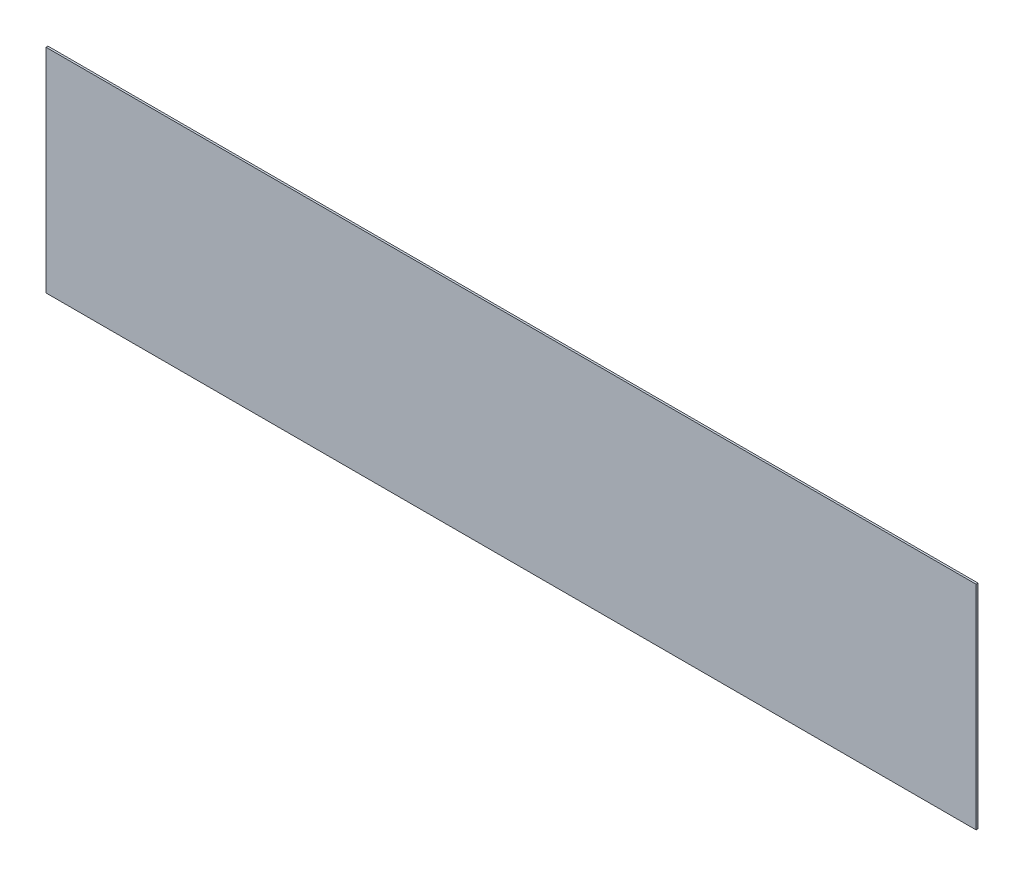
ISO-10303-21;
HEADER;
FILE_DESCRIPTION(('STEP AP214'),'2;1');
FILE_NAME('part.step','',(''),(''),'','','');
FILE_SCHEMA(('AUTOMOTIVE_DESIGN { 1 0 10303 214 1 1 1 1 }'));
ENDSEC;
DATA;
#1=APPLICATION_CONTEXT('core data for automotive mechanical design processes');
#2=APPLICATION_PROTOCOL_DEFINITION('international standard','automotive_design',2000,#1);
#3=PRODUCT_CONTEXT('',#1,'mechanical');
#4=PRODUCT('Part','Part','',(#3));
#5=PRODUCT_RELATED_PRODUCT_CATEGORY('part','',(#4));
#6=PRODUCT_DEFINITION_FORMATION('','',#4);
#7=PRODUCT_DEFINITION_CONTEXT('part definition',#1,'design');
#8=PRODUCT_DEFINITION('design','',#6,#7);
#9=PRODUCT_DEFINITION_SHAPE('','',#8);
#10=(LENGTH_UNIT() NAMED_UNIT(*) SI_UNIT(.MILLI.,.METRE.));
#11=(NAMED_UNIT(*) PLANE_ANGLE_UNIT() SI_UNIT($,.RADIAN.));
#12=(NAMED_UNIT(*) SI_UNIT($,.STERADIAN.) SOLID_ANGLE_UNIT());
#13=UNCERTAINTY_MEASURE_WITH_UNIT(LENGTH_MEASURE(1.E-05),#10,'distance_accuracy_value','');
#14=(GEOMETRIC_REPRESENTATION_CONTEXT(3) GLOBAL_UNCERTAINTY_ASSIGNED_CONTEXT((#13)) GLOBAL_UNIT_ASSIGNED_CONTEXT((#10,
#11,#12)) REPRESENTATION_CONTEXT('',''));
#15=CARTESIAN_POINT('',(0.,0.,0.));
#16=DIRECTION('',(0.,0.,1.));
#17=DIRECTION('',(1.,0.,0.));
#18=AXIS2_PLACEMENT_3D('',#15,#16,#17);
#19=CARTESIAN_POINT('',(-167.209805358834,-170.768597763726,0.12699999999965));
#20=DIRECTION('',(1.,0.,0.));
#21=DIRECTION('',(0.,0.,-1.));
#22=AXIS2_PLACEMENT_3D('',#19,#20,#21);
#23=PLANE('',#22);
#24=DIRECTION('',(0.,-1.,0.));
#25=VECTOR('',#24,1.);
#26=CARTESIAN_POINT('',(-167.209805358834,-170.768597763726,-3.94649590784724E-13));
#27=LINE('',#26,#25);
#28=CARTESIAN_POINT('',(-167.209805358834,-170.768597763726,-3.94649590784724E-13));
#29=VERTEX_POINT('',#28);
#30=CARTESIAN_POINT('',(-167.209805358834,-184.484597763727,-3.36970035208495E-13));
#31=VERTEX_POINT('',#30);
#32=EDGE_CURVE('E95',#29,#31,#27,.T.);
#33=ORIENTED_EDGE('',*,*,#32,.T.);
#34=DIRECTION('',(0.,0.,-1.));
#35=VECTOR('',#34,1.);
#36=CARTESIAN_POINT('',(-167.209805358834,-184.484597763727,0.126999999999651));
#37=LINE('',#36,#35);
#38=CARTESIAN_POINT('',(-167.209805358834,-184.484597763727,0.126999999999651));
#39=VERTEX_POINT('',#38);
#40=EDGE_CURVE('E11',#39,#31,#37,.T.);
#41=ORIENTED_EDGE('',*,*,#40,.F.);
#42=DIRECTION('',(0.,-1.,0.));
#43=VECTOR('',#42,1.);
#44=CARTESIAN_POINT('',(-167.209805358834,-170.768597763726,0.12699999999965));
#45=LINE('',#44,#43);
#46=CARTESIAN_POINT('',(-167.209805358834,-170.768597763726,0.12699999999965));
#47=VERTEX_POINT('',#46);
#48=EDGE_CURVE('E83',#47,#39,#45,.T.);
#49=ORIENTED_EDGE('',*,*,#48,.F.);
#50=DIRECTION('',(0.,0.,-1.));
#51=VECTOR('',#50,1.);
#52=CARTESIAN_POINT('',(-167.209805358834,-170.768597763726,0.12699999999965));
#53=LINE('',#52,#51);
#54=EDGE_CURVE('E91',#47,#29,#53,.T.);
#55=ORIENTED_EDGE('',*,*,#54,.T.);
#56=EDGE_LOOP('',(#33,#41,#49,#55));
#57=FACE_BOUND('',#56,.T.);
#58=ADVANCED_FACE('F32',(#57),#23,.F.);
#59=CARTESIAN_POINT('',(-167.209805358834,-184.484597763727,0.126999999999651));
#60=DIRECTION('',(0.,1.,0.));
#61=DIRECTION('',(0.,0.,1.));
#62=AXIS2_PLACEMENT_3D('',#59,#60,#61);
#63=PLANE('',#62);
#64=DIRECTION('',(1.,0.,0.));
#65=VECTOR('',#64,1.);
#66=CARTESIAN_POINT('',(-167.209805358834,-184.484597763727,-3.36970035208495E-13));
#67=LINE('',#66,#65);
#68=CARTESIAN_POINT('',(-107.265805358835,-184.484597763727,-2.6628005356244E-13));
#69=VERTEX_POINT('',#68);
#70=EDGE_CURVE('E87',#31,#69,#67,.T.);
#71=ORIENTED_EDGE('',*,*,#70,.T.);
#72=DIRECTION('',(0.,0.,-1.));
#73=VECTOR('',#72,1.);
#74=CARTESIAN_POINT('',(-107.265805358835,-184.484597763727,0.126999999999722));
#75=LINE('',#74,#73);
#76=CARTESIAN_POINT('',(-107.265805358835,-184.484597763727,0.126999999999722));
#77=VERTEX_POINT('',#76);
#78=EDGE_CURVE('E40',#77,#69,#75,.T.);
#79=ORIENTED_EDGE('',*,*,#78,.F.);
#80=DIRECTION('',(1.,0.,0.));
#81=VECTOR('',#80,1.);
#82=CARTESIAN_POINT('',(-167.209805358834,-184.484597763727,0.126999999999651));
#83=LINE('',#82,#81);
#84=EDGE_CURVE('E78',#39,#77,#83,.T.);
#85=ORIENTED_EDGE('',*,*,#84,.F.);
#86=ORIENTED_EDGE('',*,*,#40,.T.);
#87=EDGE_LOOP('',(#71,#79,#85,#86));
#88=FACE_BOUND('',#87,.T.);
#89=ADVANCED_FACE('F86',(#88),#63,.F.);
#90=CARTESIAN_POINT('',(-107.265805358835,-170.768597763726,0.126999999999724));
#91=DIRECTION('',(-1.,0.,0.));
#92=DIRECTION('',(0.,0.,1.));
#93=AXIS2_PLACEMENT_3D('',#90,#91,#92);
#94=PLANE('',#93);
#95=DIRECTION('',(0.,1.,0.));
#96=VECTOR('',#95,1.);
#97=CARTESIAN_POINT('',(-107.265805358835,-170.768597763726,-2.64111649217469E-13));
#98=LINE('',#97,#96);
#99=CARTESIAN_POINT('',(-107.265805358835,-170.768597763726,-2.64111649217469E-13));
#100=VERTEX_POINT('',#99);
#101=EDGE_CURVE('E65',#69,#100,#98,.T.);
#102=ORIENTED_EDGE('',*,*,#101,.T.);
#103=DIRECTION('',(0.,0.,-1.));
#104=VECTOR('',#103,1.);
#105=CARTESIAN_POINT('',(-107.265805358835,-170.768597763726,0.126999999999724));
#106=LINE('',#105,#104);
#107=CARTESIAN_POINT('',(-107.265805358835,-170.768597763726,0.126999999999724));
#108=VERTEX_POINT('',#107);
#109=EDGE_CURVE('E88',#108,#100,#106,.T.);
#110=ORIENTED_EDGE('',*,*,#109,.F.);
#111=DIRECTION('',(0.,1.,0.));
#112=VECTOR('',#111,1.);
#113=CARTESIAN_POINT('',(-107.265805358835,-170.768597763726,0.126999999999724));
#114=LINE('',#113,#112);
#115=EDGE_CURVE('E81',#77,#108,#114,.T.);
#116=ORIENTED_EDGE('',*,*,#115,.F.);
#117=ORIENTED_EDGE('',*,*,#78,.T.);
#118=EDGE_LOOP('',(#102,#110,#116,#117));
#119=FACE_BOUND('',#118,.T.);
#120=ADVANCED_FACE('F89',(#119),#94,.F.);
#121=CARTESIAN_POINT('',(-167.209805358834,-170.768597763726,0.12699999999965));
#122=DIRECTION('',(0.,-1.,0.));
#123=DIRECTION('',(0.,0.,-1.));
#124=AXIS2_PLACEMENT_3D('',#121,#122,#123);
#125=PLANE('',#124);
#126=DIRECTION('',(-1.,0.,0.));
#127=VECTOR('',#126,1.);
#128=CARTESIAN_POINT('',(-167.209805358834,-170.768597763726,-3.94649590784724E-13));
#129=LINE('',#128,#127);
#130=EDGE_CURVE('E71',#100,#29,#129,.T.);
#131=ORIENTED_EDGE('',*,*,#130,.T.);
#132=ORIENTED_EDGE('',*,*,#54,.F.);
#133=DIRECTION('',(-1.,0.,0.));
#134=VECTOR('',#133,1.);
#135=CARTESIAN_POINT('',(-167.209805358834,-170.768597763726,0.12699999999965));
#136=LINE('',#135,#134);
#137=EDGE_CURVE('E48',#108,#47,#136,.T.);
#138=ORIENTED_EDGE('',*,*,#137,.F.);
#139=ORIENTED_EDGE('',*,*,#109,.T.);
#140=EDGE_LOOP('',(#131,#132,#138,#139));
#141=FACE_BOUND('',#140,.T.);
#142=ADVANCED_FACE('F102',(#141),#125,.F.);
#143=CARTESIAN_POINT('',(0.,0.,0.126999999999988));
#144=DIRECTION('',(0.,0.,1.));
#145=DIRECTION('',(1.,0.,0.));
#146=AXIS2_PLACEMENT_3D('',#143,#144,#145);
#147=PLANE('',#146);
#148=ORIENTED_EDGE('',*,*,#48,.T.);
#149=ORIENTED_EDGE('',*,*,#84,.T.);
#150=ORIENTED_EDGE('',*,*,#115,.T.);
#151=ORIENTED_EDGE('',*,*,#137,.T.);
#152=EDGE_LOOP('',(#148,#149,#150,#151));
#153=FACE_BOUND('',#152,.T.);
#154=ADVANCED_FACE('F79',(#153),#147,.T.);
#155=CARTESIAN_POINT('',(0.,0.,0.));
#156=DIRECTION('',(0.,0.,1.));
#157=DIRECTION('',(1.,0.,0.));
#158=AXIS2_PLACEMENT_3D('',#155,#156,#157);
#159=PLANE('',#158);
#160=ORIENTED_EDGE('',*,*,#32,.F.);
#161=ORIENTED_EDGE('',*,*,#130,.F.);
#162=ORIENTED_EDGE('',*,*,#101,.F.);
#163=ORIENTED_EDGE('',*,*,#70,.F.);
#164=EDGE_LOOP('',(#160,#161,#162,#163));
#165=FACE_BOUND('',#164,.T.);
#166=ADVANCED_FACE('F105',(#165),#159,.F.);
#167=CLOSED_SHELL('',(#58,#89,#120,#142,#154,#166));
#168=MANIFOLD_SOLID_BREP('B2',#167);
#169=ADVANCED_BREP_SHAPE_REPRESENTATION('',(#18,#168),#14);
#170=SHAPE_DEFINITION_REPRESENTATION(#9,#169);
ENDSEC;
END-ISO-10303-21;
